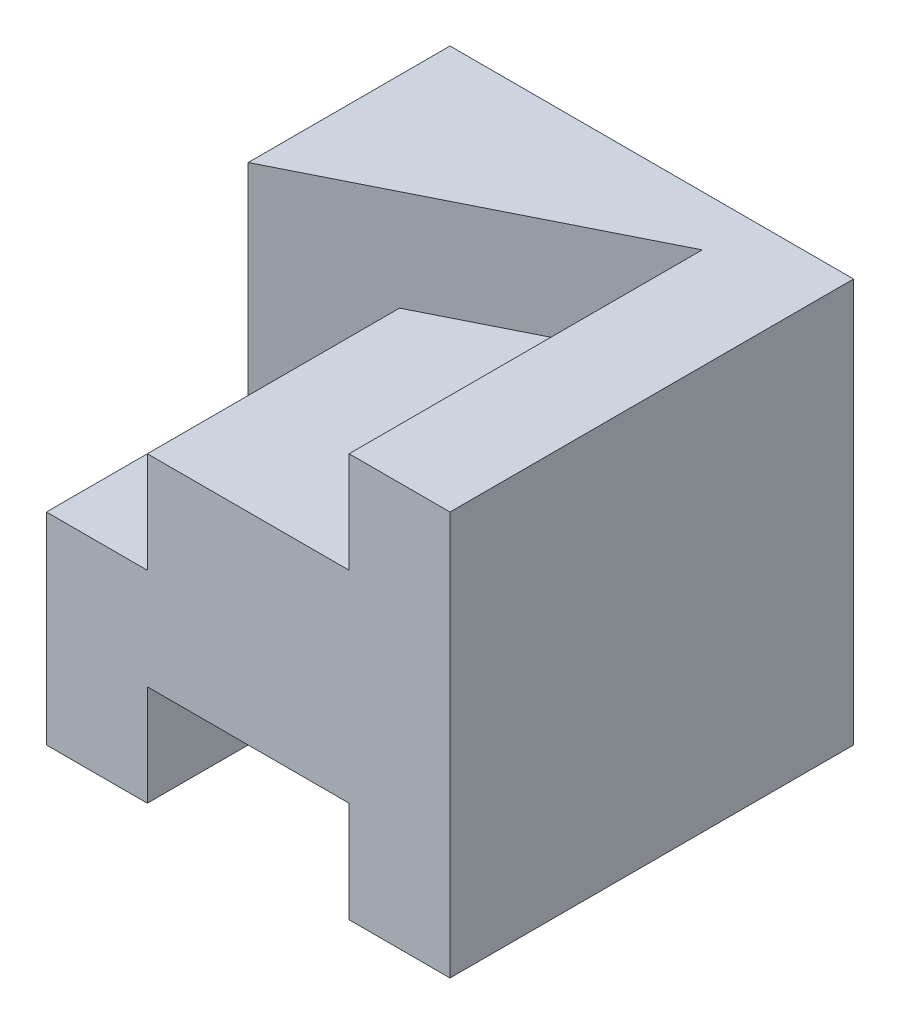
ISO-10303-21;
HEADER;
FILE_DESCRIPTION(('STEP AP214'),'2;1');
FILE_NAME('part.step','',(''),(''),'','','');
FILE_SCHEMA(('AUTOMOTIVE_DESIGN { 1 0 10303 214 1 1 1 1 }'));
ENDSEC;
DATA;
#1=APPLICATION_CONTEXT('core data for automotive mechanical design processes');
#2=APPLICATION_PROTOCOL_DEFINITION('international standard','automotive_design',2000,#1);
#3=PRODUCT_CONTEXT('',#1,'mechanical');
#4=PRODUCT('Part','Part','',(#3));
#5=PRODUCT_RELATED_PRODUCT_CATEGORY('part','',(#4));
#6=PRODUCT_DEFINITION_FORMATION('','',#4);
#7=PRODUCT_DEFINITION_CONTEXT('part definition',#1,'design');
#8=PRODUCT_DEFINITION('design','',#6,#7);
#9=PRODUCT_DEFINITION_SHAPE('','',#8);
#10=(LENGTH_UNIT() NAMED_UNIT(*) SI_UNIT(.MILLI.,.METRE.));
#11=(NAMED_UNIT(*) PLANE_ANGLE_UNIT() SI_UNIT($,.RADIAN.));
#12=(NAMED_UNIT(*) SI_UNIT($,.STERADIAN.) SOLID_ANGLE_UNIT());
#13=UNCERTAINTY_MEASURE_WITH_UNIT(LENGTH_MEASURE(1.E-05),#10,'distance_accuracy_value','');
#14=(GEOMETRIC_REPRESENTATION_CONTEXT(3) GLOBAL_UNCERTAINTY_ASSIGNED_CONTEXT((#13)) GLOBAL_UNIT_ASSIGNED_CONTEXT((#10,
#11,#12)) REPRESENTATION_CONTEXT('',''));
#15=CARTESIAN_POINT('',(0.,0.,0.));
#16=DIRECTION('',(0.,0.,1.));
#17=DIRECTION('',(1.,0.,0.));
#18=AXIS2_PLACEMENT_3D('',#15,#16,#17);
#19=CARTESIAN_POINT('',(1.,0.,4.));
#20=DIRECTION('',(0.,1.,0.));
#21=DIRECTION('',(-1.,0.,0.));
#22=AXIS2_PLACEMENT_3D('',#19,#20,#21);
#23=PLANE('',#22);
#24=DIRECTION('',(1.,0.,0.));
#25=VECTOR('',#24,1.);
#26=CARTESIAN_POINT('',(1.,0.,0.));
#27=LINE('',#26,#25);
#28=CARTESIAN_POINT('',(0.,0.,0.));
#29=VERTEX_POINT('',#28);
#30=CARTESIAN_POINT('',(1.,0.,0.));
#31=VERTEX_POINT('',#30);
#32=EDGE_CURVE('E133',#29,#31,#27,.T.);
#33=ORIENTED_EDGE('',*,*,#32,.T.);
#34=DIRECTION('',(0.,0.,-1.));
#35=VECTOR('',#34,1.);
#36=CARTESIAN_POINT('',(1.,0.,4.));
#37=LINE('',#36,#35);
#38=CARTESIAN_POINT('',(1.,0.,4.));
#39=VERTEX_POINT('',#38);
#40=EDGE_CURVE('E11',#39,#31,#37,.T.);
#41=ORIENTED_EDGE('',*,*,#40,.F.);
#42=DIRECTION('',(1.,0.,0.));
#43=VECTOR('',#42,1.);
#44=CARTESIAN_POINT('',(1.,0.,4.));
#45=LINE('',#44,#43);
#46=CARTESIAN_POINT('',(0.,0.,4.));
#47=VERTEX_POINT('',#46);
#48=EDGE_CURVE('E138',#47,#39,#45,.T.);
#49=ORIENTED_EDGE('',*,*,#48,.F.);
#50=DIRECTION('',(0.,0.,-1.));
#51=VECTOR('',#50,1.);
#52=CARTESIAN_POINT('',(0.,0.,4.));
#53=LINE('',#52,#51);
#54=EDGE_CURVE('E192',#47,#29,#53,.T.);
#55=ORIENTED_EDGE('',*,*,#54,.T.);
#56=EDGE_LOOP('',(#33,#41,#49,#55));
#57=FACE_BOUND('',#56,.T.);
#58=ADVANCED_FACE('F33',(#57),#23,.F.);
#59=CARTESIAN_POINT('',(1.,1.,4.));
#60=DIRECTION('',(-1.,0.,0.));
#61=DIRECTION('',(0.,0.,1.));
#62=AXIS2_PLACEMENT_3D('',#59,#60,#61);
#63=PLANE('',#62);
#64=DIRECTION('',(0.,1.,0.));
#65=VECTOR('',#64,1.);
#66=CARTESIAN_POINT('',(1.,1.,0.));
#67=LINE('',#66,#65);
#68=CARTESIAN_POINT('',(1.,1.,0.));
#69=VERTEX_POINT('',#68);
#70=EDGE_CURVE('E194',#31,#69,#67,.T.);
#71=ORIENTED_EDGE('',*,*,#70,.T.);
#72=DIRECTION('',(0.,0.,-1.));
#73=VECTOR('',#72,1.);
#74=CARTESIAN_POINT('',(1.,1.,4.));
#75=LINE('',#74,#73);
#76=CARTESIAN_POINT('',(1.,1.,4.));
#77=VERTEX_POINT('',#76);
#78=EDGE_CURVE('E40',#77,#69,#75,.T.);
#79=ORIENTED_EDGE('',*,*,#78,.F.);
#80=DIRECTION('',(0.,1.,0.));
#81=VECTOR('',#80,1.);
#82=CARTESIAN_POINT('',(1.,1.,4.));
#83=LINE('',#82,#81);
#84=EDGE_CURVE('E170',#39,#77,#83,.T.);
#85=ORIENTED_EDGE('',*,*,#84,.F.);
#86=ORIENTED_EDGE('',*,*,#40,.T.);
#87=EDGE_LOOP('',(#71,#79,#85,#86));
#88=FACE_BOUND('',#87,.T.);
#89=ADVANCED_FACE('F247',(#88),#63,.F.);
#90=CARTESIAN_POINT('',(3.,1.,4.));
#91=DIRECTION('',(0.,1.,0.));
#92=DIRECTION('',(-1.,0.,0.));
#93=AXIS2_PLACEMENT_3D('',#90,#91,#92);
#94=PLANE('',#93);
#95=DIRECTION('',(1.,0.,0.));
#96=VECTOR('',#95,1.);
#97=CARTESIAN_POINT('',(3.,1.,0.));
#98=LINE('',#97,#96);
#99=CARTESIAN_POINT('',(3.,1.,0.));
#100=VERTEX_POINT('',#99);
#101=EDGE_CURVE('E196',#69,#100,#98,.T.);
#102=ORIENTED_EDGE('',*,*,#101,.T.);
#103=DIRECTION('',(0.,0.,-1.));
#104=VECTOR('',#103,1.);
#105=CARTESIAN_POINT('',(3.,1.,4.));
#106=LINE('',#105,#104);
#107=CARTESIAN_POINT('',(3.,1.,4.));
#108=VERTEX_POINT('',#107);
#109=EDGE_CURVE('E222',#108,#100,#106,.T.);
#110=ORIENTED_EDGE('',*,*,#109,.F.);
#111=DIRECTION('',(1.,0.,0.));
#112=VECTOR('',#111,1.);
#113=CARTESIAN_POINT('',(3.,1.,4.));
#114=LINE('',#113,#112);
#115=EDGE_CURVE('E172',#77,#108,#114,.T.);
#116=ORIENTED_EDGE('',*,*,#115,.F.);
#117=ORIENTED_EDGE('',*,*,#78,.T.);
#118=EDGE_LOOP('',(#102,#110,#116,#117));
#119=FACE_BOUND('',#118,.T.);
#120=ADVANCED_FACE('F229',(#119),#94,.F.);
#121=CARTESIAN_POINT('',(3.,0.,4.));
#122=DIRECTION('',(1.,0.,0.));
#123=DIRECTION('',(0.,0.,-1.));
#124=AXIS2_PLACEMENT_3D('',#121,#122,#123);
#125=PLANE('',#124);
#126=DIRECTION('',(0.,-1.,0.));
#127=VECTOR('',#126,1.);
#128=CARTESIAN_POINT('',(3.,0.,0.));
#129=LINE('',#128,#127);
#130=CARTESIAN_POINT('',(3.,0.,0.));
#131=VERTEX_POINT('',#130);
#132=EDGE_CURVE('E198',#100,#131,#129,.T.);
#133=ORIENTED_EDGE('',*,*,#132,.T.);
#134=DIRECTION('',(0.,0.,-1.));
#135=VECTOR('',#134,1.);
#136=CARTESIAN_POINT('',(3.,0.,4.));
#137=LINE('',#136,#135);
#138=CARTESIAN_POINT('',(3.,0.,4.));
#139=VERTEX_POINT('',#138);
#140=EDGE_CURVE('E219',#139,#131,#137,.T.);
#141=ORIENTED_EDGE('',*,*,#140,.F.);
#142=DIRECTION('',(0.,-1.,0.));
#143=VECTOR('',#142,1.);
#144=CARTESIAN_POINT('',(3.,0.,4.));
#145=LINE('',#144,#143);
#146=EDGE_CURVE('E174',#108,#139,#145,.T.);
#147=ORIENTED_EDGE('',*,*,#146,.F.);
#148=ORIENTED_EDGE('',*,*,#109,.T.);
#149=EDGE_LOOP('',(#133,#141,#147,#148));
#150=FACE_BOUND('',#149,.T.);
#151=ADVANCED_FACE('F236',(#150),#125,.F.);
#152=CARTESIAN_POINT('',(4.,0.,4.));
#153=DIRECTION('',(0.,1.,0.));
#154=DIRECTION('',(-1.,0.,0.));
#155=AXIS2_PLACEMENT_3D('',#152,#153,#154);
#156=PLANE('',#155);
#157=DIRECTION('',(1.,0.,0.));
#158=VECTOR('',#157,1.);
#159=CARTESIAN_POINT('',(4.,0.,0.));
#160=LINE('',#159,#158);
#161=CARTESIAN_POINT('',(4.,0.,0.));
#162=VERTEX_POINT('',#161);
#163=EDGE_CURVE('E200',#131,#162,#160,.T.);
#164=ORIENTED_EDGE('',*,*,#163,.T.);
#165=DIRECTION('',(0.,0.,-1.));
#166=VECTOR('',#165,1.);
#167=CARTESIAN_POINT('',(4.,0.,4.));
#168=LINE('',#167,#166);
#169=CARTESIAN_POINT('',(4.,0.,4.));
#170=VERTEX_POINT('',#169);
#171=EDGE_CURVE('E216',#170,#162,#168,.T.);
#172=ORIENTED_EDGE('',*,*,#171,.F.);
#173=DIRECTION('',(1.,0.,0.));
#174=VECTOR('',#173,1.);
#175=CARTESIAN_POINT('',(4.,0.,4.));
#176=LINE('',#175,#174);
#177=EDGE_CURVE('E176',#139,#170,#176,.T.);
#178=ORIENTED_EDGE('',*,*,#177,.F.);
#179=ORIENTED_EDGE('',*,*,#140,.T.);
#180=EDGE_LOOP('',(#164,#172,#178,#179));
#181=FACE_BOUND('',#180,.T.);
#182=ADVANCED_FACE('F240',(#181),#156,.F.);
#183=CARTESIAN_POINT('',(4.,4.,4.));
#184=DIRECTION('',(-1.,0.,0.));
#185=DIRECTION('',(0.,-1.,0.));
#186=AXIS2_PLACEMENT_3D('',#183,#184,#185);
#187=PLANE('',#186);
#188=DIRECTION('',(0.,1.,0.));
#189=VECTOR('',#188,1.);
#190=CARTESIAN_POINT('',(4.,4.,0.));
#191=LINE('',#190,#189);
#192=CARTESIAN_POINT('',(4.,4.,0.));
#193=VERTEX_POINT('',#192);
#194=EDGE_CURVE('E150',#162,#193,#191,.T.);
#195=ORIENTED_EDGE('',*,*,#194,.T.);
#196=DIRECTION('',(0.,0.,-1.));
#197=VECTOR('',#196,1.);
#198=CARTESIAN_POINT('',(4.,4.,4.));
#199=LINE('',#198,#197);
#200=CARTESIAN_POINT('',(4.,4.,4.));
#201=VERTEX_POINT('',#200);
#202=EDGE_CURVE('E149',#201,#193,#199,.T.);
#203=ORIENTED_EDGE('',*,*,#202,.F.);
#204=DIRECTION('',(0.,1.,0.));
#205=VECTOR('',#204,1.);
#206=CARTESIAN_POINT('',(4.,4.,4.));
#207=LINE('',#206,#205);
#208=EDGE_CURVE('E178',#170,#201,#207,.T.);
#209=ORIENTED_EDGE('',*,*,#208,.F.);
#210=ORIENTED_EDGE('',*,*,#171,.T.);
#211=EDGE_LOOP('',(#195,#203,#209,#210));
#212=FACE_BOUND('',#211,.T.);
#213=ADVANCED_FACE('F289',(#212),#187,.F.);
#214=CARTESIAN_POINT('',(3.,4.,4.));
#215=DIRECTION('',(0.,-1.,0.));
#216=DIRECTION('',(0.,0.,-1.));
#217=AXIS2_PLACEMENT_3D('',#214,#215,#216);
#218=PLANE('',#217);
#219=ORIENTED_EDGE('',*,*,#202,.T.);
#220=DIRECTION('',(-1.,0.,0.));
#221=VECTOR('',#220,1.);
#222=CARTESIAN_POINT('',(3.,4.,0.));
#223=LINE('',#222,#221);
#224=CARTESIAN_POINT('',(0.,4.,0.));
#225=VERTEX_POINT('',#224);
#226=EDGE_CURVE('E131',#193,#225,#223,.T.);
#227=ORIENTED_EDGE('',*,*,#226,.T.);
#228=DIRECTION('',(0.,0.,1.));
#229=VECTOR('',#228,1.);
#230=CARTESIAN_POINT('',(0.,4.,2.));
#231=LINE('',#230,#229);
#232=CARTESIAN_POINT('',(0.,4.,2.));
#233=VERTEX_POINT('',#232);
#234=EDGE_CURVE('E145',#225,#233,#231,.T.);
#235=ORIENTED_EDGE('',*,*,#234,.T.);
#236=DIRECTION('',(0.894427190999916,0.,-0.447213595499958));
#237=VECTOR('',#236,1.);
#238=CARTESIAN_POINT('',(4.,4.,0.));
#239=LINE('',#238,#237);
#240=CARTESIAN_POINT('',(3.,4.,0.5));
#241=VERTEX_POINT('',#240);
#242=EDGE_CURVE('E156',#233,#241,#239,.T.);
#243=ORIENTED_EDGE('',*,*,#242,.T.);
#244=DIRECTION('',(0.,0.,-1.));
#245=VECTOR('',#244,1.);
#246=CARTESIAN_POINT('',(3.,4.,4.));
#247=LINE('',#246,#245);
#248=CARTESIAN_POINT('',(3.,4.,4.));
#249=VERTEX_POINT('',#248);
#250=EDGE_CURVE('E47',#249,#241,#247,.T.);
#251=ORIENTED_EDGE('',*,*,#250,.F.);
#252=DIRECTION('',(-1.,0.,0.));
#253=VECTOR('',#252,1.);
#254=CARTESIAN_POINT('',(3.,4.,4.));
#255=LINE('',#254,#253);
#256=EDGE_CURVE('E180',#201,#249,#255,.T.);
#257=ORIENTED_EDGE('',*,*,#256,.F.);
#258=EDGE_LOOP('',(#219,#227,#235,#243,#251,#257));
#259=FACE_BOUND('',#258,.T.);
#260=ADVANCED_FACE('F143',(#259),#218,.F.);
#261=CARTESIAN_POINT('',(3.,3.,4.));
#262=DIRECTION('',(1.,0.,0.));
#263=DIRECTION('',(0.,0.,-1.));
#264=AXIS2_PLACEMENT_3D('',#261,#262,#263);
#265=PLANE('',#264);
#266=ORIENTED_EDGE('',*,*,#250,.T.);
#267=DIRECTION('',(0.,-1.,0.));
#268=VECTOR('',#267,1.);
#269=CARTESIAN_POINT('',(3.,3.,0.5));
#270=LINE('',#269,#268);
#271=CARTESIAN_POINT('',(3.,3.,0.5));
#272=VERTEX_POINT('',#271);
#273=EDGE_CURVE('E51',#241,#272,#270,.T.);
#274=ORIENTED_EDGE('',*,*,#273,.T.);
#275=DIRECTION('',(0.,0.,-1.));
#276=VECTOR('',#275,1.);
#277=CARTESIAN_POINT('',(3.,3.,4.));
#278=LINE('',#277,#276);
#279=CARTESIAN_POINT('',(3.,3.,4.));
#280=VERTEX_POINT('',#279);
#281=EDGE_CURVE('E212',#280,#272,#278,.T.);
#282=ORIENTED_EDGE('',*,*,#281,.F.);
#283=DIRECTION('',(0.,-1.,0.));
#284=VECTOR('',#283,1.);
#285=CARTESIAN_POINT('',(3.,3.,4.));
#286=LINE('',#285,#284);
#287=EDGE_CURVE('E182',#249,#280,#286,.T.);
#288=ORIENTED_EDGE('',*,*,#287,.F.);
#289=EDGE_LOOP('',(#266,#274,#282,#288));
#290=FACE_BOUND('',#289,.T.);
#291=ADVANCED_FACE('F261',(#290),#265,.F.);
#292=CARTESIAN_POINT('',(1.,3.,4.));
#293=DIRECTION('',(0.,-1.,0.));
#294=DIRECTION('',(0.,0.,-1.));
#295=AXIS2_PLACEMENT_3D('',#292,#293,#294);
#296=PLANE('',#295);
#297=ORIENTED_EDGE('',*,*,#281,.T.);
#298=DIRECTION('',(-0.894427190999916,0.,0.447213595499958));
#299=VECTOR('',#298,1.);
#300=CARTESIAN_POINT('',(0.,3.,2.));
#301=LINE('',#300,#299);
#302=CARTESIAN_POINT('',(1.,3.,1.5));
#303=VERTEX_POINT('',#302);
#304=EDGE_CURVE('E165',#272,#303,#301,.T.);
#305=ORIENTED_EDGE('',*,*,#304,.T.);
#306=DIRECTION('',(0.,0.,-1.));
#307=VECTOR('',#306,1.);
#308=CARTESIAN_POINT('',(1.,3.,4.));
#309=LINE('',#308,#307);
#310=CARTESIAN_POINT('',(1.,3.,4.));
#311=VERTEX_POINT('',#310);
#312=EDGE_CURVE('E209',#311,#303,#309,.T.);
#313=ORIENTED_EDGE('',*,*,#312,.F.);
#314=DIRECTION('',(-1.,0.,0.));
#315=VECTOR('',#314,1.);
#316=CARTESIAN_POINT('',(1.,3.,4.));
#317=LINE('',#316,#315);
#318=EDGE_CURVE('E184',#280,#311,#317,.T.);
#319=ORIENTED_EDGE('',*,*,#318,.F.);
#320=EDGE_LOOP('',(#297,#305,#313,#319));
#321=FACE_BOUND('',#320,.T.);
#322=ADVANCED_FACE('F265',(#321),#296,.F.);
#323=CARTESIAN_POINT('',(1.,2.,4.));
#324=DIRECTION('',(1.,0.,0.));
#325=DIRECTION('',(0.,0.,-1.));
#326=AXIS2_PLACEMENT_3D('',#323,#324,#325);
#327=PLANE('',#326);
#328=ORIENTED_EDGE('',*,*,#312,.T.);
#329=DIRECTION('',(0.,-1.,0.));
#330=VECTOR('',#329,1.);
#331=CARTESIAN_POINT('',(1.,2.,1.5));
#332=LINE('',#331,#330);
#333=CARTESIAN_POINT('',(1.,2.,1.5));
#334=VERTEX_POINT('',#333);
#335=EDGE_CURVE('E163',#303,#334,#332,.T.);
#336=ORIENTED_EDGE('',*,*,#335,.T.);
#337=DIRECTION('',(0.,0.,-1.));
#338=VECTOR('',#337,1.);
#339=CARTESIAN_POINT('',(1.,2.,4.));
#340=LINE('',#339,#338);
#341=CARTESIAN_POINT('',(1.,2.,4.));
#342=VERTEX_POINT('',#341);
#343=EDGE_CURVE('E206',#342,#334,#340,.T.);
#344=ORIENTED_EDGE('',*,*,#343,.F.);
#345=DIRECTION('',(0.,-1.,0.));
#346=VECTOR('',#345,1.);
#347=CARTESIAN_POINT('',(1.,2.,4.));
#348=LINE('',#347,#346);
#349=EDGE_CURVE('E186',#311,#342,#348,.T.);
#350=ORIENTED_EDGE('',*,*,#349,.F.);
#351=EDGE_LOOP('',(#328,#336,#344,#350));
#352=FACE_BOUND('',#351,.T.);
#353=ADVANCED_FACE('F267',(#352),#327,.F.);
#354=CARTESIAN_POINT('',(0.,2.,4.));
#355=DIRECTION('',(0.,-1.,0.));
#356=DIRECTION('',(1.,0.,0.));
#357=AXIS2_PLACEMENT_3D('',#354,#355,#356);
#358=PLANE('',#357);
#359=ORIENTED_EDGE('',*,*,#343,.T.);
#360=DIRECTION('',(0.894427190999916,0.,-0.447213595499958));
#361=VECTOR('',#360,1.);
#362=CARTESIAN_POINT('',(4.,2.,0.));
#363=LINE('',#362,#361);
#364=CARTESIAN_POINT('',(0.,2.,2.));
#365=VERTEX_POINT('',#364);
#366=EDGE_CURVE('E158',#365,#334,#363,.T.);
#367=ORIENTED_EDGE('',*,*,#366,.F.);
#368=DIRECTION('',(0.,0.,-1.));
#369=VECTOR('',#368,1.);
#370=CARTESIAN_POINT('',(0.,2.,4.));
#371=LINE('',#370,#369);
#372=CARTESIAN_POINT('',(0.,2.,4.));
#373=VERTEX_POINT('',#372);
#374=EDGE_CURVE('E204',#373,#365,#371,.T.);
#375=ORIENTED_EDGE('',*,*,#374,.F.);
#376=DIRECTION('',(-1.,0.,0.));
#377=VECTOR('',#376,1.);
#378=CARTESIAN_POINT('',(0.,2.,4.));
#379=LINE('',#378,#377);
#380=EDGE_CURVE('E188',#342,#373,#379,.T.);
#381=ORIENTED_EDGE('',*,*,#380,.F.);
#382=EDGE_LOOP('',(#359,#367,#375,#381));
#383=FACE_BOUND('',#382,.T.);
#384=ADVANCED_FACE('F255',(#383),#358,.F.);
#385=CARTESIAN_POINT('',(0.,0.,4.));
#386=DIRECTION('',(1.,0.,0.));
#387=DIRECTION('',(0.,0.,-1.));
#388=AXIS2_PLACEMENT_3D('',#385,#386,#387);
#389=PLANE('',#388);
#390=DIRECTION('',(0.,-1.,0.));
#391=VECTOR('',#390,1.);
#392=CARTESIAN_POINT('',(0.,0.,0.));
#393=LINE('',#392,#391);
#394=EDGE_CURVE('E127',#225,#29,#393,.T.);
#395=ORIENTED_EDGE('',*,*,#394,.T.);
#396=ORIENTED_EDGE('',*,*,#54,.F.);
#397=DIRECTION('',(0.,-1.,0.));
#398=VECTOR('',#397,1.);
#399=CARTESIAN_POINT('',(0.,0.,4.));
#400=LINE('',#399,#398);
#401=EDGE_CURVE('E190',#373,#47,#400,.T.);
#402=ORIENTED_EDGE('',*,*,#401,.F.);
#403=ORIENTED_EDGE('',*,*,#374,.T.);
#404=DIRECTION('',(0.,1.,0.));
#405=VECTOR('',#404,1.);
#406=CARTESIAN_POINT('',(0.,2.,2.));
#407=LINE('',#406,#405);
#408=EDGE_CURVE('E155',#365,#233,#407,.T.);
#409=ORIENTED_EDGE('',*,*,#408,.T.);
#410=ORIENTED_EDGE('',*,*,#234,.F.);
#411=EDGE_LOOP('',(#395,#396,#402,#403,#409,#410));
#412=FACE_BOUND('',#411,.T.);
#413=ADVANCED_FACE('F152',(#412),#389,.F.);
#414=CARTESIAN_POINT('',(0.,0.,4.));
#415=DIRECTION('',(0.,0.,-1.));
#416=DIRECTION('',(-1.,0.,0.));
#417=AXIS2_PLACEMENT_3D('',#414,#415,#416);
#418=PLANE('',#417);
#419=ORIENTED_EDGE('',*,*,#48,.T.);
#420=ORIENTED_EDGE('',*,*,#84,.T.);
#421=ORIENTED_EDGE('',*,*,#115,.T.);
#422=ORIENTED_EDGE('',*,*,#146,.T.);
#423=ORIENTED_EDGE('',*,*,#177,.T.);
#424=ORIENTED_EDGE('',*,*,#208,.T.);
#425=ORIENTED_EDGE('',*,*,#256,.T.);
#426=ORIENTED_EDGE('',*,*,#287,.T.);
#427=ORIENTED_EDGE('',*,*,#318,.T.);
#428=ORIENTED_EDGE('',*,*,#349,.T.);
#429=ORIENTED_EDGE('',*,*,#380,.T.);
#430=ORIENTED_EDGE('',*,*,#401,.T.);
#431=EDGE_LOOP('',(#419,#420,#421,#422,#423,#424,#425,#426,#427,#428,#429,#430));
#432=FACE_BOUND('',#431,.T.);
#433=ADVANCED_FACE('F244',(#432),#418,.F.);
#434=CARTESIAN_POINT('',(0.,0.,0.));
#435=DIRECTION('',(0.,0.,-1.));
#436=DIRECTION('',(-1.,0.,0.));
#437=AXIS2_PLACEMENT_3D('',#434,#435,#436);
#438=PLANE('',#437);
#439=ORIENTED_EDGE('',*,*,#226,.F.);
#440=ORIENTED_EDGE('',*,*,#194,.F.);
#441=ORIENTED_EDGE('',*,*,#163,.F.);
#442=ORIENTED_EDGE('',*,*,#132,.F.);
#443=ORIENTED_EDGE('',*,*,#101,.F.);
#444=ORIENTED_EDGE('',*,*,#70,.F.);
#445=ORIENTED_EDGE('',*,*,#32,.F.);
#446=ORIENTED_EDGE('',*,*,#394,.F.);
#447=EDGE_LOOP('',(#439,#440,#441,#442,#443,#444,#445,#446));
#448=FACE_BOUND('',#447,.T.);
#449=ADVANCED_FACE('F129',(#448),#438,.T.);
#450=CARTESIAN_POINT('',(4.,2.,0.));
#451=DIRECTION('',(0.447213595499958,0.,0.894427190999916));
#452=DIRECTION('',(0.894427190999916,0.,-0.447213595499958));
#453=AXIS2_PLACEMENT_3D('',#450,#451,#452);
#454=PLANE('',#453);
#455=ORIENTED_EDGE('',*,*,#273,.F.);
#456=ORIENTED_EDGE('',*,*,#242,.F.);
#457=ORIENTED_EDGE('',*,*,#408,.F.);
#458=ORIENTED_EDGE('',*,*,#366,.T.);
#459=ORIENTED_EDGE('',*,*,#335,.F.);
#460=ORIENTED_EDGE('',*,*,#304,.F.);
#461=EDGE_LOOP('',(#455,#456,#457,#458,#459,#460));
#462=FACE_BOUND('',#461,.T.);
#463=ADVANCED_FACE('F259',(#462),#454,.T.);
#464=CLOSED_SHELL('',(#58,#89,#120,#151,#182,#213,#260,#291,#322,#353,#384,#413,#433,#449,#463));
#465=MANIFOLD_SOLID_BREP('B2',#464);
#466=ADVANCED_BREP_SHAPE_REPRESENTATION('',(#18,#465),#14);
#467=SHAPE_DEFINITION_REPRESENTATION(#9,#466);
ENDSEC;
END-ISO-10303-21;
